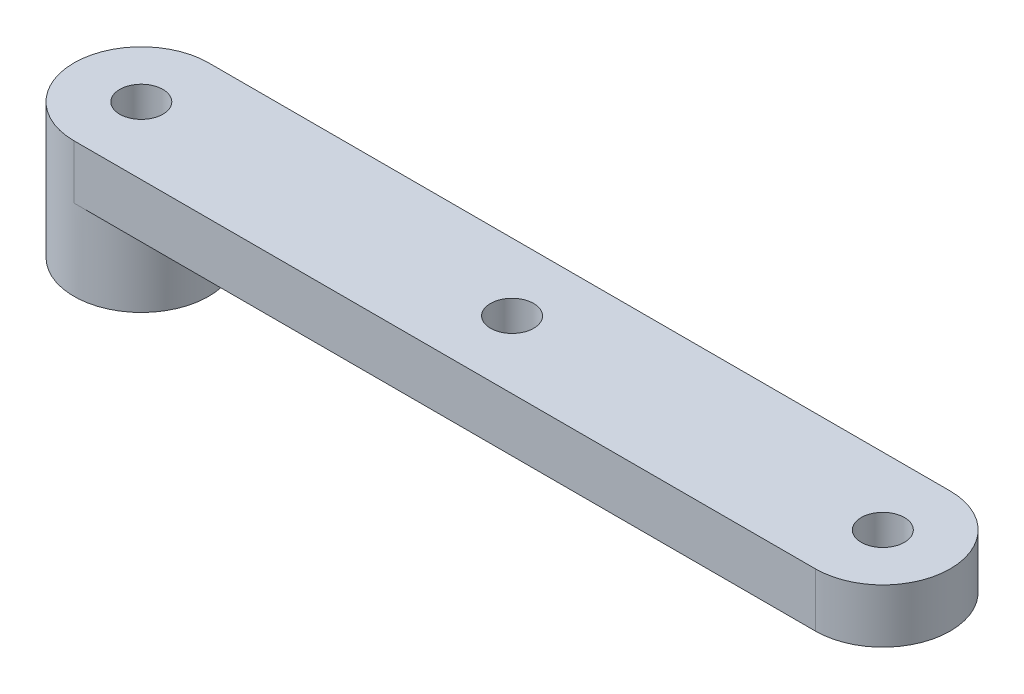
ISO-10303-21;
HEADER;
FILE_DESCRIPTION(('STEP AP214'),'2;1');
FILE_NAME('part.step','',(''),(''),'','','');
FILE_SCHEMA(('AUTOMOTIVE_DESIGN { 1 0 10303 214 1 1 1 1 }'));
ENDSEC;
DATA;
#1=APPLICATION_CONTEXT('core data for automotive mechanical design processes');
#2=APPLICATION_PROTOCOL_DEFINITION('international standard','automotive_design',2000,#1);
#3=PRODUCT_CONTEXT('',#1,'mechanical');
#4=PRODUCT('Part','Part','',(#3));
#5=PRODUCT_RELATED_PRODUCT_CATEGORY('part','',(#4));
#6=PRODUCT_DEFINITION_FORMATION('','',#4);
#7=PRODUCT_DEFINITION_CONTEXT('part definition',#1,'design');
#8=PRODUCT_DEFINITION('design','',#6,#7);
#9=PRODUCT_DEFINITION_SHAPE('','',#8);
#10=(LENGTH_UNIT() NAMED_UNIT(*) SI_UNIT(.MILLI.,.METRE.));
#11=(NAMED_UNIT(*) PLANE_ANGLE_UNIT() SI_UNIT($,.RADIAN.));
#12=(NAMED_UNIT(*) SI_UNIT($,.STERADIAN.) SOLID_ANGLE_UNIT());
#13=UNCERTAINTY_MEASURE_WITH_UNIT(LENGTH_MEASURE(1.E-05),#10,'distance_accuracy_value','');
#14=(GEOMETRIC_REPRESENTATION_CONTEXT(3) GLOBAL_UNCERTAINTY_ASSIGNED_CONTEXT((#13)) GLOBAL_UNIT_ASSIGNED_CONTEXT((#10,
#11,#12)) REPRESENTATION_CONTEXT('',''));
#15=CARTESIAN_POINT('',(0.,0.,0.));
#16=DIRECTION('',(0.,0.,1.));
#17=DIRECTION('',(1.,0.,0.));
#18=AXIS2_PLACEMENT_3D('',#15,#16,#17);
#19=CARTESIAN_POINT('',(0.,0.,0.));
#20=DIRECTION('',(0.,1.,0.));
#21=DIRECTION('',(0.,0.,1.));
#22=AXIS2_PLACEMENT_3D('',#19,#20,#21);
#23=PLANE('',#22);
#24=CARTESIAN_POINT('',(55.,0.,0.));
#25=DIRECTION('',(0.,1.,0.));
#26=DIRECTION('',(0.,0.,1.));
#27=AXIS2_PLACEMENT_3D('',#24,#25,#26);
#28=CIRCLE('',#27,1.6);
#29=CARTESIAN_POINT('',(55.,0.,1.6));
#30=VERTEX_POINT('',#29);
#31=EDGE_CURVE('E132',#30,#30,#28,.T.);
#32=ORIENTED_EDGE('',*,*,#31,.T.);
#33=EDGE_LOOP('',(#32));
#34=FACE_BOUND('',#33,.T.);
#35=CARTESIAN_POINT('',(27.5,0.,0.));
#36=DIRECTION('',(0.,1.,0.));
#37=DIRECTION('',(0.,0.,1.));
#38=AXIS2_PLACEMENT_3D('',#35,#36,#37);
#39=CIRCLE('',#38,1.6);
#40=CARTESIAN_POINT('',(27.5,0.,1.6));
#41=VERTEX_POINT('',#40);
#42=EDGE_CURVE('E140',#41,#41,#39,.T.);
#43=ORIENTED_EDGE('',*,*,#42,.T.);
#44=EDGE_LOOP('',(#43));
#45=FACE_BOUND('',#44,.T.);
#46=CARTESIAN_POINT('',(0.,0.,0.));
#47=DIRECTION('',(0.,-1.,0.));
#48=DIRECTION('',(0.,0.,-1.));
#49=AXIS2_PLACEMENT_3D('',#46,#47,#48);
#50=CIRCLE('',#49,5.);
#51=CARTESIAN_POINT('',(0.,0.,-5.));
#52=VERTEX_POINT('',#51);
#53=CARTESIAN_POINT('',(0.,0.,5.));
#54=VERTEX_POINT('',#53);
#55=EDGE_CURVE('E87',#52,#54,#50,.T.);
#56=ORIENTED_EDGE('',*,*,#55,.F.);
#57=DIRECTION('',(-1.,0.,0.));
#58=VECTOR('',#57,1.);
#59=CARTESIAN_POINT('',(0.,0.,-5.));
#60=LINE('',#59,#58);
#61=CARTESIAN_POINT('',(55.,0.,-5.));
#62=VERTEX_POINT('',#61);
#63=EDGE_CURVE('E89',#62,#52,#60,.T.);
#64=ORIENTED_EDGE('',*,*,#63,.F.);
#65=CARTESIAN_POINT('',(55.,0.,0.));
#66=DIRECTION('',(0.,1.,0.));
#67=DIRECTION('',(0.,0.,1.));
#68=AXIS2_PLACEMENT_3D('',#65,#66,#67);
#69=CIRCLE('',#68,5.);
#70=CARTESIAN_POINT('',(55.,0.,5.));
#71=VERTEX_POINT('',#70);
#72=EDGE_CURVE('E77',#71,#62,#69,.T.);
#73=ORIENTED_EDGE('',*,*,#72,.F.);
#74=DIRECTION('',(1.,0.,0.));
#75=VECTOR('',#74,1.);
#76=CARTESIAN_POINT('',(0.,0.,5.));
#77=LINE('',#76,#75);
#78=EDGE_CURVE('E70',#54,#71,#77,.T.);
#79=ORIENTED_EDGE('',*,*,#78,.F.);
#80=EDGE_LOOP('',(#56,#64,#73,#79));
#81=FACE_BOUND('',#80,.T.);
#82=ADVANCED_FACE('F38',(#34,#45,#81),#23,.F.);
#83=CARTESIAN_POINT('',(0.,4.,0.));
#84=DIRECTION('',(0.,-1.,0.));
#85=DIRECTION('',(0.,0.,-1.));
#86=AXIS2_PLACEMENT_3D('',#83,#84,#85);
#87=CYLINDRICAL_SURFACE('',#86,5.);
#88=DIRECTION('',(0.,-1.,0.));
#89=VECTOR('',#88,1.);
#90=CARTESIAN_POINT('',(0.,4.,-5.));
#91=LINE('',#90,#89);
#92=CARTESIAN_POINT('',(0.,4.,-5.));
#93=VERTEX_POINT('',#92);
#94=EDGE_CURVE('E99',#93,#52,#91,.T.);
#95=ORIENTED_EDGE('',*,*,#94,.T.);
#96=ORIENTED_EDGE('',*,*,#55,.T.);
#97=DIRECTION('',(0.,-1.,0.));
#98=VECTOR('',#97,1.);
#99=CARTESIAN_POINT('',(0.,4.,5.));
#100=LINE('',#99,#98);
#101=CARTESIAN_POINT('',(0.,4.,5.));
#102=VERTEX_POINT('',#101);
#103=EDGE_CURVE('E11',#102,#54,#100,.T.);
#104=ORIENTED_EDGE('',*,*,#103,.F.);
#105=CARTESIAN_POINT('',(0.,4.,0.));
#106=DIRECTION('',(0.,1.,0.));
#107=DIRECTION('',(0.,0.,1.));
#108=AXIS2_PLACEMENT_3D('',#105,#106,#107);
#109=CIRCLE('',#108,5.);
#110=EDGE_CURVE('E103',#93,#102,#109,.T.);
#111=ORIENTED_EDGE('',*,*,#110,.F.);
#112=EDGE_LOOP('',(#95,#96,#104,#111));
#113=FACE_BOUND('',#112,.T.);
#114=CARTESIAN_POINT('',(0.,-6.,0.));
#115=DIRECTION('',(0.,-1.,0.));
#116=DIRECTION('',(0.,0.,-1.));
#117=AXIS2_PLACEMENT_3D('',#114,#115,#116);
#118=CIRCLE('',#117,5.);
#119=CARTESIAN_POINT('',(0.,-6.,-5.));
#120=VERTEX_POINT('',#119);
#121=EDGE_CURVE('E94',#120,#120,#118,.T.);
#122=ORIENTED_EDGE('',*,*,#121,.F.);
#123=EDGE_LOOP('',(#122));
#124=FACE_BOUND('',#123,.T.);
#125=ADVANCED_FACE('F40',(#113,#124),#87,.T.);
#126=CARTESIAN_POINT('',(0.,4.,5.));
#127=DIRECTION('',(0.,0.,-1.));
#128=DIRECTION('',(-1.,0.,0.));
#129=AXIS2_PLACEMENT_3D('',#126,#127,#128);
#130=PLANE('',#129);
#131=ORIENTED_EDGE('',*,*,#78,.T.);
#132=DIRECTION('',(0.,-1.,0.));
#133=VECTOR('',#132,1.);
#134=CARTESIAN_POINT('',(55.,4.,5.));
#135=LINE('',#134,#133);
#136=CARTESIAN_POINT('',(55.,4.,5.));
#137=VERTEX_POINT('',#136);
#138=EDGE_CURVE('E48',#137,#71,#135,.T.);
#139=ORIENTED_EDGE('',*,*,#138,.F.);
#140=DIRECTION('',(1.,0.,0.));
#141=VECTOR('',#140,1.);
#142=CARTESIAN_POINT('',(0.,4.,5.));
#143=LINE('',#142,#141);
#144=EDGE_CURVE('E82',#102,#137,#143,.T.);
#145=ORIENTED_EDGE('',*,*,#144,.F.);
#146=ORIENTED_EDGE('',*,*,#103,.T.);
#147=EDGE_LOOP('',(#131,#139,#145,#146));
#148=FACE_BOUND('',#147,.T.);
#149=ADVANCED_FACE('F162',(#148),#130,.F.);
#150=CARTESIAN_POINT('',(55.,4.,0.));
#151=DIRECTION('',(0.,-1.,0.));
#152=DIRECTION('',(0.,0.,-1.));
#153=AXIS2_PLACEMENT_3D('',#150,#151,#152);
#154=CYLINDRICAL_SURFACE('',#153,5.);
#155=ORIENTED_EDGE('',*,*,#72,.T.);
#156=DIRECTION('',(0.,-1.,0.));
#157=VECTOR('',#156,1.);
#158=CARTESIAN_POINT('',(55.,4.,-5.));
#159=LINE('',#158,#157);
#160=CARTESIAN_POINT('',(55.,4.,-5.));
#161=VERTEX_POINT('',#160);
#162=EDGE_CURVE('E101',#161,#62,#159,.T.);
#163=ORIENTED_EDGE('',*,*,#162,.F.);
#164=CARTESIAN_POINT('',(55.,4.,0.));
#165=DIRECTION('',(0.,1.,0.));
#166=DIRECTION('',(0.,0.,1.));
#167=AXIS2_PLACEMENT_3D('',#164,#165,#166);
#168=CIRCLE('',#167,5.);
#169=EDGE_CURVE('E111',#137,#161,#168,.T.);
#170=ORIENTED_EDGE('',*,*,#169,.F.);
#171=ORIENTED_EDGE('',*,*,#138,.T.);
#172=EDGE_LOOP('',(#155,#163,#170,#171));
#173=FACE_BOUND('',#172,.T.);
#174=ADVANCED_FACE('F116',(#173),#154,.T.);
#175=CARTESIAN_POINT('',(0.,4.,-5.));
#176=DIRECTION('',(0.,0.,1.));
#177=DIRECTION('',(1.,0.,0.));
#178=AXIS2_PLACEMENT_3D('',#175,#176,#177);
#179=PLANE('',#178);
#180=ORIENTED_EDGE('',*,*,#63,.T.);
#181=ORIENTED_EDGE('',*,*,#94,.F.);
#182=DIRECTION('',(-1.,0.,0.));
#183=VECTOR('',#182,1.);
#184=CARTESIAN_POINT('',(0.,4.,-5.));
#185=LINE('',#184,#183);
#186=EDGE_CURVE('E56',#161,#93,#185,.T.);
#187=ORIENTED_EDGE('',*,*,#186,.F.);
#188=ORIENTED_EDGE('',*,*,#162,.T.);
#189=EDGE_LOOP('',(#180,#181,#187,#188));
#190=FACE_BOUND('',#189,.T.);
#191=ADVANCED_FACE('F98',(#190),#179,.F.);
#192=CARTESIAN_POINT('',(0.,4.,0.));
#193=DIRECTION('',(0.,1.,0.));
#194=DIRECTION('',(0.,0.,1.));
#195=AXIS2_PLACEMENT_3D('',#192,#193,#194);
#196=PLANE('',#195);
#197=CARTESIAN_POINT('',(0.,4.,0.));
#198=DIRECTION('',(0.,1.,0.));
#199=DIRECTION('',(0.,0.,1.));
#200=AXIS2_PLACEMENT_3D('',#197,#198,#199);
#201=CIRCLE('',#200,1.6);
#202=CARTESIAN_POINT('',(0.,4.,1.6));
#203=VERTEX_POINT('',#202);
#204=EDGE_CURVE('E119',#203,#203,#201,.T.);
#205=ORIENTED_EDGE('',*,*,#204,.F.);
#206=EDGE_LOOP('',(#205));
#207=FACE_BOUND('',#206,.T.);
#208=CARTESIAN_POINT('',(27.5,4.,0.));
#209=DIRECTION('',(0.,1.,0.));
#210=DIRECTION('',(0.,0.,1.));
#211=AXIS2_PLACEMENT_3D('',#208,#209,#210);
#212=CIRCLE('',#211,1.6);
#213=CARTESIAN_POINT('',(27.5,4.,1.6));
#214=VERTEX_POINT('',#213);
#215=EDGE_CURVE('E136',#214,#214,#212,.T.);
#216=ORIENTED_EDGE('',*,*,#215,.F.);
#217=EDGE_LOOP('',(#216));
#218=FACE_BOUND('',#217,.T.);
#219=CARTESIAN_POINT('',(55.,4.,0.));
#220=DIRECTION('',(0.,1.,0.));
#221=DIRECTION('',(0.,0.,1.));
#222=AXIS2_PLACEMENT_3D('',#219,#220,#221);
#223=CIRCLE('',#222,1.6);
#224=CARTESIAN_POINT('',(55.,4.,1.6));
#225=VERTEX_POINT('',#224);
#226=EDGE_CURVE('E128',#225,#225,#223,.T.);
#227=ORIENTED_EDGE('',*,*,#226,.F.);
#228=EDGE_LOOP('',(#227));
#229=FACE_BOUND('',#228,.T.);
#230=ORIENTED_EDGE('',*,*,#110,.T.);
#231=ORIENTED_EDGE('',*,*,#144,.T.);
#232=ORIENTED_EDGE('',*,*,#169,.T.);
#233=ORIENTED_EDGE('',*,*,#186,.T.);
#234=EDGE_LOOP('',(#230,#231,#232,#233));
#235=FACE_BOUND('',#234,.T.);
#236=ADVANCED_FACE('F177',(#207,#218,#229,#235),#196,.T.);
#237=CARTESIAN_POINT('',(55.,0.,0.));
#238=DIRECTION('',(0.,1.,0.));
#239=DIRECTION('',(0.,0.,1.));
#240=AXIS2_PLACEMENT_3D('',#237,#238,#239);
#241=CYLINDRICAL_SURFACE('',#240,1.6);
#242=ORIENTED_EDGE('',*,*,#31,.F.);
#243=EDGE_LOOP('',(#242));
#244=FACE_BOUND('',#243,.T.);
#245=ORIENTED_EDGE('',*,*,#226,.T.);
#246=EDGE_LOOP('',(#245));
#247=FACE_BOUND('',#246,.T.);
#248=ADVANCED_FACE('F201',(#244,#247),#241,.F.);
#249=CARTESIAN_POINT('',(27.5,0.,0.));
#250=DIRECTION('',(0.,1.,0.));
#251=DIRECTION('',(0.,0.,1.));
#252=AXIS2_PLACEMENT_3D('',#249,#250,#251);
#253=CYLINDRICAL_SURFACE('',#252,1.6);
#254=ORIENTED_EDGE('',*,*,#42,.F.);
#255=EDGE_LOOP('',(#254));
#256=FACE_BOUND('',#255,.T.);
#257=ORIENTED_EDGE('',*,*,#215,.T.);
#258=EDGE_LOOP('',(#257));
#259=FACE_BOUND('',#258,.T.);
#260=ADVANCED_FACE('F207',(#256,#259),#253,.F.);
#261=CARTESIAN_POINT('',(0.,0.,0.));
#262=DIRECTION('',(0.,1.,0.));
#263=DIRECTION('',(0.,0.,1.));
#264=AXIS2_PLACEMENT_3D('',#261,#262,#263);
#265=CYLINDRICAL_SURFACE('',#264,1.6);
#266=ORIENTED_EDGE('',*,*,#204,.T.);
#267=EDGE_LOOP('',(#266));
#268=FACE_BOUND('',#267,.T.);
#269=CARTESIAN_POINT('',(0.,-6.,0.));
#270=DIRECTION('',(0.,-1.,0.));
#271=DIRECTION('',(0.,0.,-1.));
#272=AXIS2_PLACEMENT_3D('',#269,#270,#271);
#273=CIRCLE('',#272,1.6);
#274=CARTESIAN_POINT('',(0.,-6.,-1.6));
#275=VERTEX_POINT('',#274);
#276=EDGE_CURVE('E95',#275,#275,#273,.T.);
#277=ORIENTED_EDGE('',*,*,#276,.T.);
#278=EDGE_LOOP('',(#277));
#279=FACE_BOUND('',#278,.T.);
#280=ADVANCED_FACE('F154',(#268,#279),#265,.F.);
#281=CARTESIAN_POINT('',(0.,-6.,0.));
#282=DIRECTION('',(0.,-1.,0.));
#283=DIRECTION('',(0.,0.,-1.));
#284=AXIS2_PLACEMENT_3D('',#281,#282,#283);
#285=PLANE('',#284);
#286=ORIENTED_EDGE('',*,*,#276,.F.);
#287=EDGE_LOOP('',(#286));
#288=FACE_BOUND('',#287,.T.);
#289=ORIENTED_EDGE('',*,*,#121,.T.);
#290=EDGE_LOOP('',(#289));
#291=FACE_BOUND('',#290,.T.);
#292=ADVANCED_FACE('F156',(#288,#291),#285,.T.);
#293=CLOSED_SHELL('',(#82,#125,#149,#174,#191,#236,#248,#260,#280,#292));
#294=MANIFOLD_SOLID_BREP('B2',#293);
#295=ADVANCED_BREP_SHAPE_REPRESENTATION('',(#18,#294),#14);
#296=SHAPE_DEFINITION_REPRESENTATION(#9,#295);
ENDSEC;
END-ISO-10303-21;
